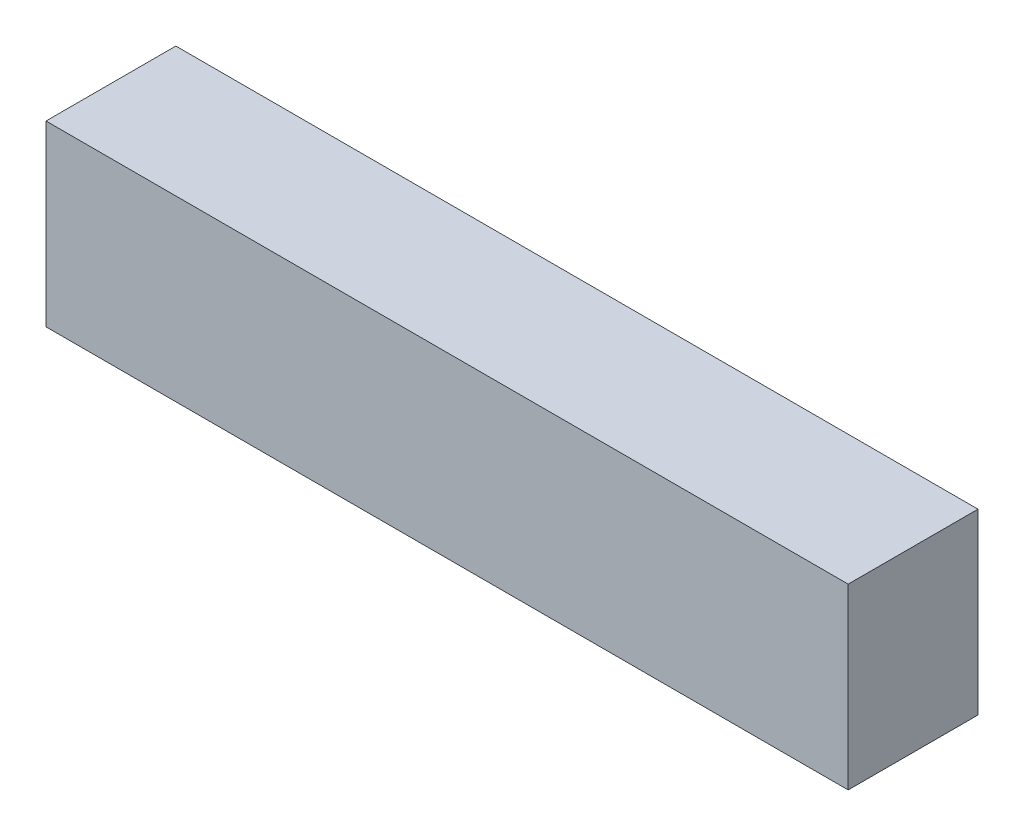
ISO-10303-21;
HEADER;
FILE_DESCRIPTION(('STEP AP214'),'2;1');
FILE_NAME('part.step','',(''),(''),'','','');
FILE_SCHEMA(('AUTOMOTIVE_DESIGN { 1 0 10303 214 1 1 1 1 }'));
ENDSEC;
DATA;
#1=APPLICATION_CONTEXT('core data for automotive mechanical design processes');
#2=APPLICATION_PROTOCOL_DEFINITION('international standard','automotive_design',2000,#1);
#3=PRODUCT_CONTEXT('',#1,'mechanical');
#4=PRODUCT('Part','Part','',(#3));
#5=PRODUCT_RELATED_PRODUCT_CATEGORY('part','',(#4));
#6=PRODUCT_DEFINITION_FORMATION('','',#4);
#7=PRODUCT_DEFINITION_CONTEXT('part definition',#1,'design');
#8=PRODUCT_DEFINITION('design','',#6,#7);
#9=PRODUCT_DEFINITION_SHAPE('','',#8);
#10=(LENGTH_UNIT() NAMED_UNIT(*) SI_UNIT(.MILLI.,.METRE.));
#11=(NAMED_UNIT(*) PLANE_ANGLE_UNIT() SI_UNIT($,.RADIAN.));
#12=(NAMED_UNIT(*) SI_UNIT($,.STERADIAN.) SOLID_ANGLE_UNIT());
#13=UNCERTAINTY_MEASURE_WITH_UNIT(LENGTH_MEASURE(1.E-05),#10,'distance_accuracy_value','');
#14=(GEOMETRIC_REPRESENTATION_CONTEXT(3) GLOBAL_UNCERTAINTY_ASSIGNED_CONTEXT((#13)) GLOBAL_UNIT_ASSIGNED_CONTEXT((#10,
#11,#12)) REPRESENTATION_CONTEXT('',''));
#15=CARTESIAN_POINT('',(0.,0.,0.));
#16=DIRECTION('',(0.,0.,1.));
#17=DIRECTION('',(1.,0.,0.));
#18=AXIS2_PLACEMENT_3D('',#15,#16,#17);
#19=CARTESIAN_POINT('',(0.,0.,3.7));
#20=DIRECTION('',(0.,0.,-1.));
#21=DIRECTION('',(-1.,0.,0.));
#22=AXIS2_PLACEMENT_3D('',#19,#20,#21);
#23=PLANE('',#22);
#24=DIRECTION('',(1.,0.,0.));
#25=VECTOR('',#24,1.);
#26=CARTESIAN_POINT('',(11.43,-2.54,3.7));
#27=LINE('',#26,#25);
#28=CARTESIAN_POINT('',(11.43,-2.54,3.7));
#29=VERTEX_POINT('',#28);
#30=CARTESIAN_POINT('',(-11.43,-2.54,3.7));
#31=VERTEX_POINT('',#30);
#32=EDGE_CURVE('E67',#29,#31,#27,.F.);
#33=ORIENTED_EDGE('',*,*,#32,.F.);
#34=DIRECTION('',(0.,1.,0.));
#35=VECTOR('',#34,1.);
#36=CARTESIAN_POINT('',(11.43,2.54,3.7));
#37=LINE('',#36,#35);
#38=CARTESIAN_POINT('',(11.43,2.54,3.7));
#39=VERTEX_POINT('',#38);
#40=EDGE_CURVE('E54',#39,#29,#37,.F.);
#41=ORIENTED_EDGE('',*,*,#40,.F.);
#42=DIRECTION('',(1.,0.,0.));
#43=VECTOR('',#42,1.);
#44=CARTESIAN_POINT('',(-11.43,2.54,3.7));
#45=LINE('',#44,#43);
#46=CARTESIAN_POINT('',(-11.43,2.54,3.7));
#47=VERTEX_POINT('',#46);
#48=EDGE_CURVE('E19',#47,#39,#45,.T.);
#49=ORIENTED_EDGE('',*,*,#48,.F.);
#50=DIRECTION('',(0.,1.,0.));
#51=VECTOR('',#50,1.);
#52=CARTESIAN_POINT('',(-11.43,-2.54,3.7));
#53=LINE('',#52,#51);
#54=EDGE_CURVE('E79',#31,#47,#53,.T.);
#55=ORIENTED_EDGE('',*,*,#54,.F.);
#56=EDGE_LOOP('',(#33,#41,#49,#55));
#57=FACE_BOUND('',#56,.T.);
#58=ADVANCED_FACE('F16',(#57),#23,.F.);
#59=CARTESIAN_POINT('',(-11.43,2.54,0.));
#60=DIRECTION('',(0.,1.,0.));
#61=DIRECTION('',(0.,0.,1.));
#62=AXIS2_PLACEMENT_3D('',#59,#60,#61);
#63=PLANE('',#62);
#64=DIRECTION('',(0.,0.,-1.));
#65=VECTOR('',#64,1.);
#66=CARTESIAN_POINT('',(11.43,2.54,0.));
#67=LINE('',#66,#65);
#68=CARTESIAN_POINT('',(11.43,2.54,0.));
#69=VERTEX_POINT('',#68);
#70=EDGE_CURVE('E60',#69,#39,#67,.F.);
#71=ORIENTED_EDGE('',*,*,#70,.F.);
#72=DIRECTION('',(-1.,0.,0.));
#73=VECTOR('',#72,1.);
#74=CARTESIAN_POINT('',(0.,2.54,0.));
#75=LINE('',#74,#73);
#76=CARTESIAN_POINT('',(-11.43,2.54,0.));
#77=VERTEX_POINT('',#76);
#78=EDGE_CURVE('E82',#77,#69,#75,.F.);
#79=ORIENTED_EDGE('',*,*,#78,.F.);
#80=DIRECTION('',(0.,0.,1.));
#81=VECTOR('',#80,1.);
#82=CARTESIAN_POINT('',(-11.43,2.54,0.));
#83=LINE('',#82,#81);
#84=EDGE_CURVE('E63',#47,#77,#83,.F.);
#85=ORIENTED_EDGE('',*,*,#84,.F.);
#86=ORIENTED_EDGE('',*,*,#48,.T.);
#87=EDGE_LOOP('',(#71,#79,#85,#86));
#88=FACE_BOUND('',#87,.T.);
#89=ADVANCED_FACE('F59',(#88),#63,.T.);
#90=CARTESIAN_POINT('',(11.43,2.54,0.));
#91=DIRECTION('',(1.,0.,0.));
#92=DIRECTION('',(0.,0.,-1.));
#93=AXIS2_PLACEMENT_3D('',#90,#91,#92);
#94=PLANE('',#93);
#95=DIRECTION('',(0.,0.,-1.));
#96=VECTOR('',#95,1.);
#97=CARTESIAN_POINT('',(11.43,-2.54,0.));
#98=LINE('',#97,#96);
#99=CARTESIAN_POINT('',(11.43,-2.54,0.));
#100=VERTEX_POINT('',#99);
#101=EDGE_CURVE('E69',#100,#29,#98,.F.);
#102=ORIENTED_EDGE('',*,*,#101,.F.);
#103=DIRECTION('',(0.,1.,0.));
#104=VECTOR('',#103,1.);
#105=CARTESIAN_POINT('',(11.43,0.,0.));
#106=LINE('',#105,#104);
#107=EDGE_CURVE('E73',#69,#100,#106,.F.);
#108=ORIENTED_EDGE('',*,*,#107,.F.);
#109=ORIENTED_EDGE('',*,*,#70,.T.);
#110=ORIENTED_EDGE('',*,*,#40,.T.);
#111=EDGE_LOOP('',(#102,#108,#109,#110));
#112=FACE_BOUND('',#111,.T.);
#113=ADVANCED_FACE('F71',(#112),#94,.T.);
#114=CARTESIAN_POINT('',(11.43,-2.54,0.));
#115=DIRECTION('',(0.,-1.,0.));
#116=DIRECTION('',(0.,0.,-1.));
#117=AXIS2_PLACEMENT_3D('',#114,#115,#116);
#118=PLANE('',#117);
#119=DIRECTION('',(0.,0.,1.));
#120=VECTOR('',#119,1.);
#121=CARTESIAN_POINT('',(-11.43,-2.54,0.));
#122=LINE('',#121,#120);
#123=CARTESIAN_POINT('',(-11.43,-2.54,0.));
#124=VERTEX_POINT('',#123);
#125=EDGE_CURVE('E34',#124,#31,#122,.T.);
#126=ORIENTED_EDGE('',*,*,#125,.F.);
#127=DIRECTION('',(-1.,0.,0.));
#128=VECTOR('',#127,1.);
#129=CARTESIAN_POINT('',(0.,-2.54,0.));
#130=LINE('',#129,#128);
#131=EDGE_CURVE('E25',#100,#124,#130,.T.);
#132=ORIENTED_EDGE('',*,*,#131,.F.);
#133=ORIENTED_EDGE('',*,*,#101,.T.);
#134=ORIENTED_EDGE('',*,*,#32,.T.);
#135=EDGE_LOOP('',(#126,#132,#133,#134));
#136=FACE_BOUND('',#135,.T.);
#137=ADVANCED_FACE('F88',(#136),#118,.T.);
#138=CARTESIAN_POINT('',(-11.43,-2.54,0.));
#139=DIRECTION('',(-1.,0.,0.));
#140=DIRECTION('',(0.,0.,1.));
#141=AXIS2_PLACEMENT_3D('',#138,#139,#140);
#142=PLANE('',#141);
#143=ORIENTED_EDGE('',*,*,#84,.T.);
#144=DIRECTION('',(0.,1.,0.));
#145=VECTOR('',#144,1.);
#146=CARTESIAN_POINT('',(-11.43,0.,0.));
#147=LINE('',#146,#145);
#148=EDGE_CURVE('E11',#124,#77,#147,.T.);
#149=ORIENTED_EDGE('',*,*,#148,.F.);
#150=ORIENTED_EDGE('',*,*,#125,.T.);
#151=ORIENTED_EDGE('',*,*,#54,.T.);
#152=EDGE_LOOP('',(#143,#149,#150,#151));
#153=FACE_BOUND('',#152,.T.);
#154=ADVANCED_FACE('F90',(#153),#142,.T.);
#155=CARTESIAN_POINT('',(0.,0.,0.));
#156=DIRECTION('',(0.,0.,-1.));
#157=DIRECTION('',(-1.,0.,0.));
#158=AXIS2_PLACEMENT_3D('',#155,#156,#157);
#159=PLANE('',#158);
#160=ORIENTED_EDGE('',*,*,#131,.T.);
#161=ORIENTED_EDGE('',*,*,#148,.T.);
#162=ORIENTED_EDGE('',*,*,#78,.T.);
#163=ORIENTED_EDGE('',*,*,#107,.T.);
#164=EDGE_LOOP('',(#160,#161,#162,#163));
#165=FACE_BOUND('',#164,.T.);
#166=ADVANCED_FACE('F87',(#165),#159,.T.);
#167=CLOSED_SHELL('',(#58,#89,#113,#137,#154,#166));
#168=MANIFOLD_SOLID_BREP('B1',#167);
#169=ADVANCED_BREP_SHAPE_REPRESENTATION('',(#18,#168),#14);
#170=SHAPE_DEFINITION_REPRESENTATION(#9,#169);
ENDSEC;
END-ISO-10303-21;
